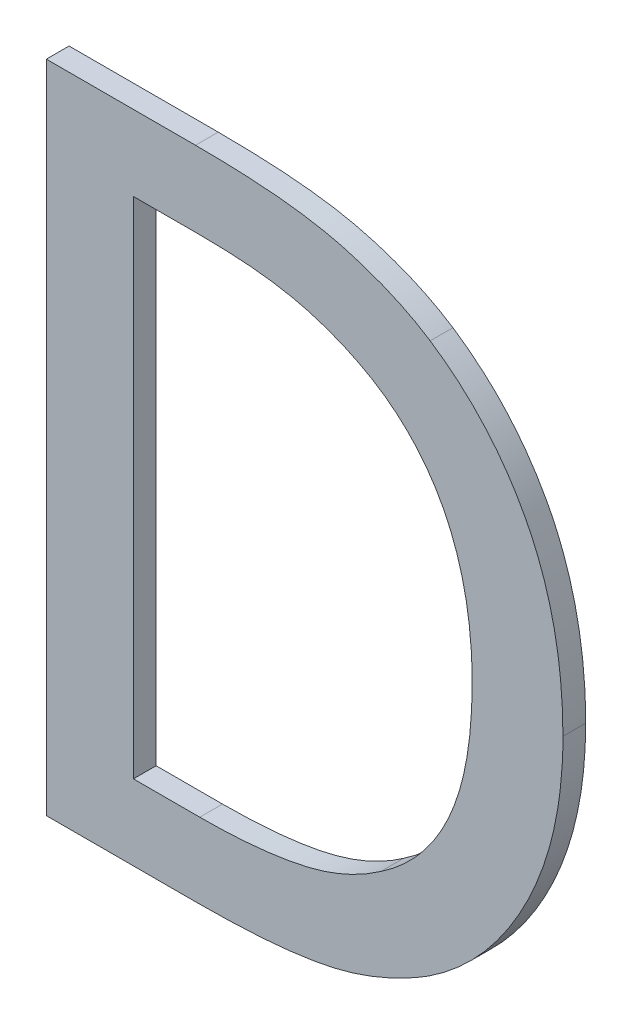
ISO-10303-21;
HEADER;
FILE_DESCRIPTION(('STEP AP214'),'2;1');
FILE_NAME('part.step','',(''),(''),'','','');
FILE_SCHEMA(('AUTOMOTIVE_DESIGN { 1 0 10303 214 1 1 1 1 }'));
ENDSEC;
DATA;
#1=APPLICATION_CONTEXT('core data for automotive mechanical design processes');
#2=APPLICATION_PROTOCOL_DEFINITION('international standard','automotive_design',2000,#1);
#3=PRODUCT_CONTEXT('',#1,'mechanical');
#4=PRODUCT('Part','Part','',(#3));
#5=PRODUCT_RELATED_PRODUCT_CATEGORY('part','',(#4));
#6=PRODUCT_DEFINITION_FORMATION('','',#4);
#7=PRODUCT_DEFINITION_CONTEXT('part definition',#1,'design');
#8=PRODUCT_DEFINITION('design','',#6,#7);
#9=PRODUCT_DEFINITION_SHAPE('','',#8);
#10=(LENGTH_UNIT() NAMED_UNIT(*) SI_UNIT(.MILLI.,.METRE.));
#11=(NAMED_UNIT(*) PLANE_ANGLE_UNIT() SI_UNIT($,.RADIAN.));
#12=(NAMED_UNIT(*) SI_UNIT($,.STERADIAN.) SOLID_ANGLE_UNIT());
#13=UNCERTAINTY_MEASURE_WITH_UNIT(LENGTH_MEASURE(1.E-05),#10,'distance_accuracy_value','');
#14=(GEOMETRIC_REPRESENTATION_CONTEXT(3) GLOBAL_UNCERTAINTY_ASSIGNED_CONTEXT((#13)) GLOBAL_UNIT_ASSIGNED_CONTEXT((#10,
#11,#12)) REPRESENTATION_CONTEXT('',''));
#15=CARTESIAN_POINT('',(0.,0.,0.));
#16=DIRECTION('',(0.,0.,1.));
#17=DIRECTION('',(1.,0.,0.));
#18=AXIS2_PLACEMENT_3D('',#15,#16,#17);
#19=CARTESIAN_POINT('',(-1.22244333232435,-1.32361111170383,0.0042));
#20=DIRECTION('',(0.,0.,1.));
#21=DIRECTION('',(1.,0.,0.));
#22=AXIS2_PLACEMENT_3D('',#19,#20,#21);
#23=PLANE('',#22);
#24=CARTESIAN_POINT('',(-1.1656769492699,-1.40593117939234,0.0042));
#25=CARTESIAN_POINT('',(-1.16226796214847,-1.40368877482768,0.0042));
#26=CARTESIAN_POINT('',(-1.15904539890132,-1.40117312148421,0.0042));
#27=CARTESIAN_POINT('',(-1.15303547050781,-1.39569927236588,0.0042));
#28=CARTESIAN_POINT('',(-1.15024559715268,-1.39274383795295,0.0042));
#29=CARTESIAN_POINT('',(-1.14484406240184,-1.38612562144251,0.0042));
#30=CARTESIAN_POINT('',(-1.14228432387684,-1.38242090616149,0.0042));
#31=CARTESIAN_POINT('',(-1.13768094104223,-1.37469999552973,0.0042));
#32=CARTESIAN_POINT('',(-1.13563804822855,-1.37068335759889,0.0042));
#33=CARTESIAN_POINT('',(-1.13191418630698,-1.36190527264501,0.0042));
#34=CARTESIAN_POINT('',(-1.1303064474216,-1.35711238699186,0.0042));
#35=CARTESIAN_POINT('',(-1.12781738074853,-1.34734839305711,0.0042));
#36=CARTESIAN_POINT('',(-1.1269358697401,-1.34237733005849,0.0042));
#37=CARTESIAN_POINT('',(-1.12588239899949,-1.33286794975659,0.0042));
#38=CARTESIAN_POINT('',(-1.12564777423236,-1.32833662705058,0.0042));
#39=CARTESIAN_POINT('',(-1.12565101838801,-1.32381448786085,0.0042));
#40=B_SPLINE_CURVE_WITH_KNOTS('',3,(#24,#25,#26,#27,#28,#29,#30,#31,#32,#33,#34,#35,#36,#37,#38,
#39),.UNSPECIFIED.,.F.,.F.,(4,2,2,2,2,2,2,4),(0.,0.012220338752033,0.0243669537254382,
0.0378275002875943,0.0513075074959657,0.0664111469989445,0.0815109748221222,0.0950859288527692),.UNSPECIFIED.);
#41=CARTESIAN_POINT('',(-1.1656769492699,-1.40593117939234,0.0042));
#42=VERTEX_POINT('',#41);
#43=CARTESIAN_POINT('',(-1.12565101838801,-1.32381448786085,0.0042));
#44=VERTEX_POINT('',#43);
#45=EDGE_CURVE('E11',#42,#44,#40,.T.);
#46=ORIENTED_EDGE('',*,*,#45,.T.);
#47=CARTESIAN_POINT('',(-1.12565101838801,-1.32381448786085,0.0042));
#48=CARTESIAN_POINT('',(-1.12565290059432,-1.31799965080703,0.0042));
#49=CARTESIAN_POINT('',(-1.12597508426444,-1.31214864847267,0.0042));
#50=CARTESIAN_POINT('',(-1.12745340390291,-1.30052821918136,0.0042));
#51=CARTESIAN_POINT('',(-1.12861371511452,-1.29475934866056,0.0042));
#52=CARTESIAN_POINT('',(-1.13155869649536,-1.28488321817492,0.0042));
#53=CARTESIAN_POINT('',(-1.13312346728012,-1.28071251122146,0.0042));
#54=CARTESIAN_POINT('',(-1.13686364637336,-1.27266586466135,0.0042));
#55=CARTESIAN_POINT('',(-1.1390376404095,-1.26878926847114,0.0042));
#56=CARTESIAN_POINT('',(-1.14378560580661,-1.26162870927181,0.0042));
#57=CARTESIAN_POINT('',(-1.14632667953457,-1.25832294836917,0.0042));
#58=CARTESIAN_POINT('',(-1.15188013365115,-1.25213348457786,0.0042));
#59=CARTESIAN_POINT('',(-1.15489240591479,-1.24924968515564,0.0042));
#60=CARTESIAN_POINT('',(-1.1604221620977,-1.24468100403373,0.0042));
#61=CARTESIAN_POINT('',(-1.16284813763665,-1.24288443142156,0.0042));
#62=CARTESIAN_POINT('',(-1.16535928326501,-1.24122129707704,0.0042));
#63=B_SPLINE_CURVE_WITH_KNOTS('',3,(#47,#48,#49,#50,#51,#52,#53,#54,#55,#56,#57,#58,#59,#60,#61,
#62),.UNSPECIFIED.,.F.,.F.,(4,2,2,2,2,2,2,4),(0.,0.0174937450949404,0.0350752439697529,
0.0483893974746255,0.0616728954901593,0.0741379375117156,0.0866001233896698,0.0956376538121001),.UNSPECIFIED.);
#64=CARTESIAN_POINT('',(-1.16535928315179,-1.2412212971522,0.0042));
#65=VERTEX_POINT('',#64);
#66=EDGE_CURVE('E138',#44,#65,#63,.T.);
#67=ORIENTED_EDGE('',*,*,#66,.T.);
#68=CARTESIAN_POINT('',(-1.16535928315179,-1.2412212971522,0.0042));
#69=CARTESIAN_POINT('',(-1.16823475249016,-1.23932528678903,0.0042));
#70=CARTESIAN_POINT('',(-1.17124353399517,-1.23766151187396,0.0042));
#71=CARTESIAN_POINT('',(-1.17743609494553,-1.23472068739466,0.0042));
#72=CARTESIAN_POINT('',(-1.18061933486027,-1.2334425171367,0.0042));
#73=CARTESIAN_POINT('',(-1.1867507698406,-1.23130236310595,0.0042));
#74=CARTESIAN_POINT('',(-1.18968898715093,-1.2304109232701,0.0042));
#75=CARTESIAN_POINT('',(-1.19564026265934,-1.22891986244688,0.0042));
#76=CARTESIAN_POINT('',(-1.19865334011094,-1.22832031736677,0.0042));
#77=CARTESIAN_POINT('',(-1.20504620014062,-1.22730070538555,0.0042));
#78=CARTESIAN_POINT('',(-1.20842995589935,-1.22690753664746,0.0042));
#79=CARTESIAN_POINT('',(-1.2152143750171,-1.22629850619677,0.0042));
#80=CARTESIAN_POINT('',(-1.21861504852914,-1.2260827684374,0.0042));
#81=CARTESIAN_POINT('',(-1.22427635940779,-1.22583515212994,0.0042));
#82=CARTESIAN_POINT('',(-1.22653550609128,-1.22576583184974,0.0042));
#83=CARTESIAN_POINT('',(-1.23105098877634,-1.22567640286385,0.0042));
#84=CARTESIAN_POINT('',(-1.23330732307525,-1.22565621118488,0.0042));
#85=CARTESIAN_POINT('',(-1.23556349525417,-1.2256556573648,0.0042));
#86=B_SPLINE_CURVE_WITH_KNOTS('',3,(#68,#69,#70,#71,#72,#73,#74,#75,#76,#77,#78,#79,#80,#81,#82,
#83,#84,#85),.UNSPECIFIED.,.F.,.F.,(4,2,2,2,2,2,2,2,4),(0.,0.0102983651994068,
0.0205665050529865,0.0297669387901097,0.0389697638247065,0.0491819738678982,0.0594013121117726,
0.0661814255224453,0.0729500800273479),.UNSPECIFIED.);
#87=CARTESIAN_POINT('',(-1.23556349525415,-1.2256556573648,0.0042));
#88=VERTEX_POINT('',#87);
#89=EDGE_CURVE('E270',#65,#88,#86,.T.);
#90=ORIENTED_EDGE('',*,*,#89,.T.);
#91=DIRECTION('',(-1.,0.,0.));
#92=VECTOR('',#91,1.);
#93=CARTESIAN_POINT('',(-1.23556349525415,-1.2256556573648,0.0042));
#94=LINE('',#93,#92);
#95=CARTESIAN_POINT('',(-1.28019558484863,-1.2256556573648,0.0042));
#96=VERTEX_POINT('',#95);
#97=EDGE_CURVE('E262',#88,#96,#94,.T.);
#98=ORIENTED_EDGE('',*,*,#97,.T.);
#99=DIRECTION('',(0.,-1.,0.));
#100=VECTOR('',#99,1.);
#101=CARTESIAN_POINT('',(-1.28019558484863,-1.2256556573648,0.0042));
#102=LINE('',#101,#100);
#103=CARTESIAN_POINT('',(-1.28019558484863,-1.4216556522388,0.0042));
#104=VERTEX_POINT('',#103);
#105=EDGE_CURVE('E327',#96,#104,#102,.T.);
#106=ORIENTED_EDGE('',*,*,#105,.T.);
#107=DIRECTION('',(1.,0.,0.));
#108=VECTOR('',#107,1.);
#109=CARTESIAN_POINT('',(-1.28019558484863,-1.4216556522388,0.0042));
#110=LINE('',#109,#108);
#111=CARTESIAN_POINT('',(-1.23508699607698,-1.4216556522388,0.0042));
#112=VERTEX_POINT('',#111);
#113=EDGE_CURVE('E335',#104,#112,#110,.T.);
#114=ORIENTED_EDGE('',*,*,#113,.T.);
#115=CARTESIAN_POINT('',(-1.23508699607698,-1.4216556522388,0.0042));
#116=CARTESIAN_POINT('',(-1.22965782614013,-1.42163315204298,0.0042));
#117=CARTESIAN_POINT('',(-1.22421078016452,-1.42152815236535,0.0042));
#118=CARTESIAN_POINT('',(-1.21332106706438,-1.4209299200821,0.0042));
#119=CARTESIAN_POINT('',(-1.20787848617369,-1.42043529229897,0.0042));
#120=CARTESIAN_POINT('',(-1.20018365291523,-1.41929270774119,0.0042));
#121=CARTESIAN_POINT('',(-1.19789680592243,-1.41889654344238,0.0042));
#122=CARTESIAN_POINT('',(-1.19501421588754,-1.41828448437914,0.0042));
#123=CARTESIAN_POINT('',(-1.19440162416368,-1.41814786626207,0.0042));
#124=CARTESIAN_POINT('',(-1.19297246162667,-1.41781106029646,0.0042));
#125=CARTESIAN_POINT('',(-1.19215726174407,-1.41760503913988,0.0042));
#126=CARTESIAN_POINT('',(-1.18970584979281,-1.41694554278227,0.0042));
#127=CARTESIAN_POINT('',(-1.18807980094703,-1.41645389838984,0.0042));
#128=CARTESIAN_POINT('',(-1.18316830045464,-1.41480736921464,0.0042));
#129=CARTESIAN_POINT('',(-1.17993436535907,-1.41349836626551,0.0042));
#130=CARTESIAN_POINT('',(-1.17295528696028,-1.41022287629815,0.0042));
#131=CARTESIAN_POINT('',(-1.16924739777442,-1.40817580079866,0.0042));
#132=CARTESIAN_POINT('',(-1.16567694926363,-1.40593117938841,0.0042));
#133=B_SPLINE_CURVE_WITH_KNOTS('',3,(#115,#116,#117,#118,#119,#120,#121,#122,#123,#124,#125,
#126,#127,#128,#129,#130,#131,#132),.UNSPECIFIED.,.F.,.F.,(4,2,2,2,2,2,2,2,4),(0.,
0.016316861040279,0.0326924164488062,0.0396499415949164,0.0415327145926748,0.0440548165126128,
0.0491478489597155,0.059591960010783,0.0722536707700071),.UNSPECIFIED.);
#134=EDGE_CURVE('E379',#112,#42,#133,.T.);
#135=ORIENTED_EDGE('',*,*,#134,.T.);
#136=EDGE_LOOP('',(#46,#67,#90,#98,#106,#114,#135));
#137=FACE_BOUND('',#136,.T.);
#138=CARTESIAN_POINT('',(-1.18013075764391,-1.38607704701045,0.0042));
#139=CARTESIAN_POINT('',(-1.18278640678735,-1.38794205282062,0.0042));
#140=CARTESIAN_POINT('',(-1.18558917076831,-1.38960230047919,0.0042));
#141=CARTESIAN_POINT('',(-1.19137209302119,-1.39245370417578,0.0042));
#142=CARTESIAN_POINT('',(-1.19434900342481,-1.39365145283762,0.0042));
#143=CARTESIAN_POINT('',(-1.20089937565251,-1.3957186678996,0.0042));
#144=CARTESIAN_POINT('',(-1.20449576820312,-1.39651294853562,0.0042));
#145=CARTESIAN_POINT('',(-1.21176358422995,-1.39775109159515,0.0042));
#146=CARTESIAN_POINT('',(-1.21543535126144,-1.39819253938611,0.0042));
#147=CARTESIAN_POINT('',(-1.22165229347342,-1.39871443313328,0.0042));
#148=CARTESIAN_POINT('',(-1.22419178641683,-1.39886452129769,0.0042));
#149=CARTESIAN_POINT('',(-1.22925211653744,-1.39905728258083,0.0042));
#150=CARTESIAN_POINT('',(-1.2317729162793,-1.39910090887609,0.0042));
#151=CARTESIAN_POINT('',(-1.2342928307817,-1.39910135785297,0.0042));
#152=B_SPLINE_CURVE_WITH_KNOTS('',3,(#138,#139,#140,#141,#142,#143,#144,#145,#146,#147,#148,
#149,#150,#151),.UNSPECIFIED.,.F.,.F.,(4,2,2,2,2,2,4),(0.,0.00973135167306938,
0.0193183611732213,0.0303293610604299,0.0414150851931192,0.0490444027715868,0.056605158618522),.UNSPECIFIED.);
#153=CARTESIAN_POINT('',(-1.18013075764391,-1.38607704701045,0.0042));
#154=VERTEX_POINT('',#153);
#155=CARTESIAN_POINT('',(-1.2342928307817,-1.39910135785297,0.0042));
#156=VERTEX_POINT('',#155);
#157=EDGE_CURVE('E222',#154,#156,#152,.T.);
#158=ORIENTED_EDGE('',*,*,#157,.T.);
#159=DIRECTION('',(-1.,0.,0.));
#160=VECTOR('',#159,1.);
#161=CARTESIAN_POINT('',(-1.2342928307817,-1.39910135785297,0.0042));
#162=LINE('',#161,#160);
#163=CARTESIAN_POINT('',(-1.25414696316359,-1.39910135785297,0.0042));
#164=VERTEX_POINT('',#163);
#165=EDGE_CURVE('E269',#156,#164,#162,.T.);
#166=ORIENTED_EDGE('',*,*,#165,.T.);
#167=DIRECTION('',(0.,1.,0.));
#168=VECTOR('',#167,1.);
#169=CARTESIAN_POINT('',(-1.25414696316359,-1.39910135785297,0.0042));
#170=LINE('',#169,#168);
#171=CARTESIAN_POINT('',(-1.25414696316359,-1.24820995175062,0.0042));
#172=VERTEX_POINT('',#171);
#173=EDGE_CURVE('E319',#164,#172,#170,.T.);
#174=ORIENTED_EDGE('',*,*,#173,.T.);
#175=DIRECTION('',(1.,0.,0.));
#176=VECTOR('',#175,1.);
#177=CARTESIAN_POINT('',(-1.25414696316359,-1.24820995175062,0.0042));
#178=LINE('',#177,#176);
#179=CARTESIAN_POINT('',(-1.2342928307817,-1.24820995175062,0.0042));
#180=VERTEX_POINT('',#179);
#181=EDGE_CURVE('E329',#172,#180,#178,.T.);
#182=ORIENTED_EDGE('',*,*,#181,.T.);
#183=CARTESIAN_POINT('',(-1.2342928307817,-1.24820995175062,0.0042));
#184=CARTESIAN_POINT('',(-1.23007624953366,-1.24823666020874,0.0042));
#185=CARTESIAN_POINT('',(-1.22583741090546,-1.24833668599334,0.0042));
#186=CARTESIAN_POINT('',(-1.21736605095977,-1.24890369685636,0.0042));
#187=CARTESIAN_POINT('',(-1.21313366977018,-1.24937253345549,0.0042));
#188=CARTESIAN_POINT('',(-1.20647879141162,-1.25058926986174,0.0042));
#189=CARTESIAN_POINT('',(-1.20402338439327,-1.25114487193716,0.0042));
#190=CARTESIAN_POINT('',(-1.19918384883077,-1.25249047857274,0.0042));
#191=CARTESIAN_POINT('',(-1.19679956191657,-1.25327991160303,0.0042));
#192=CARTESIAN_POINT('',(-1.19239495381733,-1.25497438686888,0.0042));
#193=CARTESIAN_POINT('',(-1.19036501373185,-1.25585459847605,0.0042));
#194=CARTESIAN_POINT('',(-1.18637858814226,-1.25778406584953,0.0042));
#195=CARTESIAN_POINT('',(-1.18442237588658,-1.25883388625941,0.0042));
#196=CARTESIAN_POINT('',(-1.18251325352913,-1.25996359812106,0.0042));
#197=B_SPLINE_CURVE_WITH_KNOTS('',3,(#183,#184,#185,#186,#187,#188,#189,#190,#191,#192,#193,
#194,#195,#196),.UNSPECIFIED.,.F.,.F.,(4,2,2,2,2,2,4),(0.,0.0126870376171845,0.0254381769188613,
0.0329792319329267,0.0405020050868415,0.047132198769791,0.0537849379035661),.UNSPECIFIED.);
#198=CARTESIAN_POINT('',(-1.18251325352974,-1.2599635981207,0.0042));
#199=VERTEX_POINT('',#198);
#200=EDGE_CURVE('E336',#180,#199,#197,.T.);
#201=ORIENTED_EDGE('',*,*,#200,.T.);
#202=CARTESIAN_POINT('',(-1.18251325352974,-1.2599635981207,0.0042));
#203=CARTESIAN_POINT('',(-1.17997489491251,-1.26150994269405,0.0042));
#204=CARTESIAN_POINT('',(-1.17755407198908,-1.26325368654539,0.0042));
#205=CARTESIAN_POINT('',(-1.17302135416949,-1.26708784348986,0.0042));
#206=CARTESIAN_POINT('',(-1.17090828507756,-1.2691768703508,0.0042));
#207=CARTESIAN_POINT('',(-1.1670791572081,-1.27362540238694,0.0042));
#208=CARTESIAN_POINT('',(-1.16535657614708,-1.27597929653661,0.0042));
#209=CARTESIAN_POINT('',(-1.16227782362398,-1.28091413183741,0.0042));
#210=CARTESIAN_POINT('',(-1.16092170320191,-1.28349510454935,0.0042));
#211=CARTESIAN_POINT('',(-1.15703147567877,-1.29225985739344,0.0042));
#212=CARTESIAN_POINT('',(-1.1552541523089,-1.29877030837585,0.0042));
#213=CARTESIAN_POINT('',(-1.15320444668248,-1.31140484052071,0.0042));
#214=CARTESIAN_POINT('',(-1.15280611012585,-1.31750757490977,0.0042));
#215=CARTESIAN_POINT('',(-1.15281147148643,-1.32349682174274,0.0042));
#216=B_SPLINE_CURVE_WITH_KNOTS('',3,(#202,#203,#204,#205,#206,#207,#208,#209,#210,#211,#212,
#213,#214,#215),.UNSPECIFIED.,.F.,.F.,(4,2,2,2,2,2,4),(0.,0.00891216131327491,
0.0177893747438777,0.0265051163780563,0.0352220713007727,0.0552574035849195,0.0734060894511739),.UNSPECIFIED.);
#217=CARTESIAN_POINT('',(-1.15281147148643,-1.32349682174274,0.0042));
#218=VERTEX_POINT('',#217);
#219=EDGE_CURVE('E373',#199,#218,#216,.T.);
#220=ORIENTED_EDGE('',*,*,#219,.T.);
#221=CARTESIAN_POINT('',(-1.15281147148643,-1.32349682174274,0.0042));
#222=CARTESIAN_POINT('',(-1.1528331713859,-1.32809372733658,0.0042));
#223=CARTESIAN_POINT('',(-1.15302530779963,-1.33271368628184,0.0042));
#224=CARTESIAN_POINT('',(-1.15399149791638,-1.3419501292428,0.0042));
#225=CARTESIAN_POINT('',(-1.15477335974063,-1.3465657271906,0.0042));
#226=CARTESIAN_POINT('',(-1.15756005724956,-1.35707621611907,0.0042));
#227=CARTESIAN_POINT('',(-1.15987851177529,-1.36290237656357,0.0042));
#228=CARTESIAN_POINT('',(-1.16594889395841,-1.37295710207709,0.0042));
#229=CARTESIAN_POINT('',(-1.16952487892519,-1.37728915531179,0.0042));
#230=CARTESIAN_POINT('',(-1.17567556956797,-1.38285765520499,0.0042));
#231=CARTESIAN_POINT('',(-1.17784805593206,-1.38455460502626,0.0042));
#232=CARTESIAN_POINT('',(-1.180130757745,-1.38607704707863,0.0042));
#233=B_SPLINE_CURVE_WITH_KNOTS('',3,(#221,#222,#223,#224,#225,#226,#227,#228,#229,#230,#231,
#232),.UNSPECIFIED.,.F.,.F.,(4,2,2,2,2,4),(0.,0.0138215914949219,0.0278294690303939,
0.0463651923326638,0.0629559480585555,0.0711944872630673),.UNSPECIFIED.);
#234=EDGE_CURVE('E253',#218,#154,#233,.T.);
#235=ORIENTED_EDGE('',*,*,#234,.T.);
#236=EDGE_LOOP('',(#158,#166,#174,#182,#201,#220,#235));
#237=FACE_BOUND('',#236,.T.);
#238=ADVANCED_FACE('F17',(#137,#237),#23,.T.);
#239=CARTESIAN_POINT('',(-1.18013075764391,-1.38607704701045,-0.0026));
#240=CARTESIAN_POINT('',(-1.18013075764391,-1.38607704701045,0.0042));
#241=CARTESIAN_POINT('',(-1.16647111456517,-1.37686472958526,-0.0026));
#242=CARTESIAN_POINT('',(-1.16647111456517,-1.37686472958526,0.0042));
#243=CARTESIAN_POINT('',(-1.15281147148643,-1.34636878224668,-0.0026));
#244=CARTESIAN_POINT('',(-1.15281147148643,-1.34636878224668,0.0042));
#245=CARTESIAN_POINT('',(-1.15281147148643,-1.32349682174274,-0.0026));
#246=CARTESIAN_POINT('',(-1.15281147148643,-1.32349682174274,0.0042));
#247=B_SPLINE_SURFACE_WITH_KNOTS('',2,1,((#239,#240),(#241,#242),(#243,#244),(#245,#246)),
.UNSPECIFIED.,.F.,.F.,.F.,(3,1,3),(2,2),(0.,0.5,1.),(0.,1.),.UNSPECIFIED.);
#248=CARTESIAN_POINT('',(-1.18013075764391,-1.38607704701045,-0.0026));
#249=CARTESIAN_POINT('',(-1.17766654141075,-1.3844219587591,-0.0026));
#250=CARTESIAN_POINT('',(-1.1753293141664,-1.38257949955947,-0.0026));
#251=CARTESIAN_POINT('',(-1.17097541913938,-1.37856119415743,-0.0026));
#252=CARTESIAN_POINT('',(-1.16895779433595,-1.37638638311356,-0.0026));
#253=CARTESIAN_POINT('',(-1.16354778612808,-1.36951706015858,-0.0026));
#254=CARTESIAN_POINT('',(-1.16067806382398,-1.36439670698081,-0.0026));
#255=CARTESIAN_POINT('',(-1.15623812786505,-1.35318179785166,-0.0026));
#256=CARTESIAN_POINT('',(-1.1547976967479,-1.34704151431949,-0.0026));
#257=CARTESIAN_POINT('',(-1.15314255738751,-1.33505845631907,-0.0026));
#258=CARTESIAN_POINT('',(-1.15284324328928,-1.32922839308657,-0.0026));
#259=CARTESIAN_POINT('',(-1.15281147148643,-1.32349682174274,-0.0026));
#260=B_SPLINE_CURVE_WITH_KNOTS('',3,(#248,#249,#250,#251,#252,#253,#254,#255,#256,#257,#258,
#259),.UNSPECIFIED.,.F.,.F.,(4,2,2,2,2,4),(0.,0.00889393051447318,0.017760703863996,
0.0350788794411588,0.0538554261933466,0.0712092277444972),.UNSPECIFIED.);
#261=CARTESIAN_POINT('',(-1.18013075764391,-1.38607704701045,-0.0026));
#262=VERTEX_POINT('',#261);
#263=CARTESIAN_POINT('',(-1.15281147148643,-1.32349682174274,-0.0026));
#264=VERTEX_POINT('',#263);
#265=EDGE_CURVE('E30',#262,#264,#260,.T.);
#266=DIRECTION('',(0.,0.,1.));
#267=VECTOR('',#266,1.);
#268=CARTESIAN_POINT('',(-1.18013075764391,-1.38607704701045,-0.0026));
#269=LINE('',#268,#267);
#270=EDGE_CURVE('E223',#262,#154,#269,.T.);
#271=DIRECTION('',(0.,0.,1.));
#272=VECTOR('',#271,1.);
#273=CARTESIAN_POINT('',(-1.15281147148643,-1.32349682174274,-0.0026));
#274=LINE('',#273,#272);
#275=EDGE_CURVE('E316',#264,#218,#274,.T.);
#276=ORIENTED_EDGE('',*,*,#265,.F.);
#277=ORIENTED_EDGE('',*,*,#270,.T.);
#278=ORIENTED_EDGE('',*,*,#234,.F.);
#279=ORIENTED_EDGE('',*,*,#275,.F.);
#280=EDGE_LOOP('',(#276,#277,#278,#279));
#281=FACE_BOUND('',#280,.T.);
#282=ADVANCED_FACE('F238',(#281),#247,.F.);
#283=CARTESIAN_POINT('',(-1.2342928307817,-1.39910135785297,-0.0026));
#284=CARTESIAN_POINT('',(-1.2342928307817,-1.39910135785297,0.0042));
#285=CARTESIAN_POINT('',(-1.2169800273447,-1.39910135785297,-0.0026));
#286=CARTESIAN_POINT('',(-1.2169800273447,-1.39910135785297,0.0042));
#287=CARTESIAN_POINT('',(-1.19077257260061,-1.39354220078604,-0.0026));
#288=CARTESIAN_POINT('',(-1.19077257260061,-1.39354220078604,0.0042));
#289=CARTESIAN_POINT('',(-1.18013075764391,-1.38607704701045,-0.0026));
#290=CARTESIAN_POINT('',(-1.18013075764391,-1.38607704701045,0.0042));
#291=B_SPLINE_SURFACE_WITH_KNOTS('',2,1,((#283,#284),(#285,#286),(#287,#288),(#289,#290)),
.UNSPECIFIED.,.F.,.F.,.F.,(3,1,3),(2,2),(0.,0.5,1.),(0.,1.),.UNSPECIFIED.);
#292=CARTESIAN_POINT('',(-1.2342928307817,-1.39910135785297,-0.0026));
#293=CARTESIAN_POINT('',(-1.23177180883286,-1.399099530763,-0.0026));
#294=CARTESIAN_POINT('',(-1.22924971822862,-1.39905654962234,-0.0026));
#295=CARTESIAN_POINT('',(-1.22420265803102,-1.39886557857411,-0.0026));
#296=CARTESIAN_POINT('',(-1.22167769989146,-1.39871729739724,-0.0026));
#297=CARTESIAN_POINT('',(-1.21659155731685,-1.39828885329593,-0.0026));
#298=CARTESIAN_POINT('',(-1.21403056826159,-1.39800629821952,-0.0026));
#299=CARTESIAN_POINT('',(-1.208930571878,-1.39729663068613,-0.0026));
#300=CARTESIAN_POINT('',(-1.20639154545421,-1.39686966027755,-0.0026));
#301=CARTESIAN_POINT('',(-1.20059767638249,-1.39560761625002,-0.0026));
#302=CARTESIAN_POINT('',(-1.19735945930984,-1.39468801244633,-0.0026));
#303=CARTESIAN_POINT('',(-1.19109563119323,-1.39234327676198,-0.0026));
#304=CARTESIAN_POINT('',(-1.1880686230821,-1.39092193963783,-0.0026));
#305=CARTESIAN_POINT('',(-1.18344269872714,-1.38828719394088,-0.0026));
#306=CARTESIAN_POINT('',(-1.18175903420392,-1.38722004801915,-0.0026));
#307=CARTESIAN_POINT('',(-1.18013075756667,-1.38607704695627,-0.0026));
#308=B_SPLINE_CURVE_WITH_KNOTS('',3,(#292,#293,#294,#295,#296,#297,#298,#299,#300,#301,#302,
#303,#304,#305,#306,#307),.UNSPECIFIED.,.F.,.F.,(4,2,2,2,2,2,2,4),(0.,0.00756444232666839,
0.0151498904889554,0.0228758548212939,0.0305942418093433,0.0406551626389473,0.050641564995139,
0.0566117657849047),.UNSPECIFIED.);
#309=CARTESIAN_POINT('',(-1.2342928307817,-1.39910135785297,-0.0026));
#310=VERTEX_POINT('',#309);
#311=EDGE_CURVE('E214',#310,#262,#308,.T.);
#312=DIRECTION('',(0.,0.,1.));
#313=VECTOR('',#312,1.);
#314=CARTESIAN_POINT('',(-1.2342928307817,-1.39910135785297,-0.0026));
#315=LINE('',#314,#313);
#316=EDGE_CURVE('E261',#310,#156,#315,.T.);
#317=ORIENTED_EDGE('',*,*,#311,.F.);
#318=ORIENTED_EDGE('',*,*,#316,.T.);
#319=ORIENTED_EDGE('',*,*,#157,.F.);
#320=ORIENTED_EDGE('',*,*,#270,.F.);
#321=EDGE_LOOP('',(#317,#318,#319,#320));
#322=FACE_BOUND('',#321,.T.);
#323=ADVANCED_FACE('F165',(#322),#291,.F.);
#324=CARTESIAN_POINT('',(-1.25414696316359,-1.39910135785297,-0.0026));
#325=DIRECTION('',(0.,-1.,0.));
#326=DIRECTION('',(1.,0.,0.));
#327=AXIS2_PLACEMENT_3D('',#324,#325,#326);
#328=PLANE('',#327);
#329=DIRECTION('',(1.,0.,0.));
#330=VECTOR('',#329,1.);
#331=CARTESIAN_POINT('',(-1.25414696316359,-1.39910135785297,-0.0026));
#332=LINE('',#331,#330);
#333=CARTESIAN_POINT('',(-1.25414696316359,-1.39910135785297,-0.0026));
#334=VERTEX_POINT('',#333);
#335=EDGE_CURVE('E266',#334,#310,#332,.T.);
#336=ORIENTED_EDGE('',*,*,#335,.F.);
#337=DIRECTION('',(0.,0.,1.));
#338=VECTOR('',#337,1.);
#339=CARTESIAN_POINT('',(-1.25414696316359,-1.39910135785297,-0.0026));
#340=LINE('',#339,#338);
#341=EDGE_CURVE('E312',#334,#164,#340,.T.);
#342=ORIENTED_EDGE('',*,*,#341,.T.);
#343=ORIENTED_EDGE('',*,*,#165,.F.);
#344=ORIENTED_EDGE('',*,*,#316,.F.);
#345=EDGE_LOOP('',(#336,#342,#343,#344));
#346=FACE_BOUND('',#345,.T.);
#347=ADVANCED_FACE('F285',(#346),#328,.F.);
#348=CARTESIAN_POINT('',(-1.25414696316359,-1.24820995175062,-0.0026));
#349=DIRECTION('',(-1.,0.,0.));
#350=DIRECTION('',(0.,-1.,0.));
#351=AXIS2_PLACEMENT_3D('',#348,#349,#350);
#352=PLANE('',#351);
#353=DIRECTION('',(0.,-1.,0.));
#354=VECTOR('',#353,1.);
#355=CARTESIAN_POINT('',(-1.25414696316359,-1.24820995175062,-0.0026));
#356=LINE('',#355,#354);
#357=CARTESIAN_POINT('',(-1.25414696316359,-1.24820995175062,-0.0026));
#358=VERTEX_POINT('',#357);
#359=EDGE_CURVE('E315',#358,#334,#356,.T.);
#360=ORIENTED_EDGE('',*,*,#359,.F.);
#361=DIRECTION('',(0.,0.,1.));
#362=VECTOR('',#361,1.);
#363=CARTESIAN_POINT('',(-1.25414696316359,-1.24820995175062,-0.0026));
#364=LINE('',#363,#362);
#365=EDGE_CURVE('E321',#358,#172,#364,.T.);
#366=ORIENTED_EDGE('',*,*,#365,.T.);
#367=ORIENTED_EDGE('',*,*,#173,.F.);
#368=ORIENTED_EDGE('',*,*,#341,.F.);
#369=EDGE_LOOP('',(#360,#366,#367,#368));
#370=FACE_BOUND('',#369,.T.);
#371=ADVANCED_FACE('F283',(#370),#352,.F.);
#372=CARTESIAN_POINT('',(-1.2342928307817,-1.24820995175062,-0.0026));
#373=DIRECTION('',(0.,1.,0.));
#374=DIRECTION('',(-1.,0.,0.));
#375=AXIS2_PLACEMENT_3D('',#372,#373,#374);
#376=PLANE('',#375);
#377=DIRECTION('',(-1.,0.,0.));
#378=VECTOR('',#377,1.);
#379=CARTESIAN_POINT('',(-1.2342928307817,-1.24820995175062,-0.0026));
#380=LINE('',#379,#378);
#381=CARTESIAN_POINT('',(-1.2342928307817,-1.24820995175062,-0.0026));
#382=VERTEX_POINT('',#381);
#383=EDGE_CURVE('E331',#382,#358,#380,.T.);
#384=ORIENTED_EDGE('',*,*,#383,.F.);
#385=DIRECTION('',(0.,0.,1.));
#386=VECTOR('',#385,1.);
#387=CARTESIAN_POINT('',(-1.2342928307817,-1.24820995175062,-0.0026));
#388=LINE('',#387,#386);
#389=EDGE_CURVE('E384',#382,#180,#388,.T.);
#390=ORIENTED_EDGE('',*,*,#389,.T.);
#391=ORIENTED_EDGE('',*,*,#181,.F.);
#392=ORIENTED_EDGE('',*,*,#365,.F.);
#393=EDGE_LOOP('',(#384,#390,#391,#392));
#394=FACE_BOUND('',#393,.T.);
#395=ADVANCED_FACE('F299',(#394),#376,.F.);
#396=CARTESIAN_POINT('',(-1.18251325352974,-1.2599635981207,-0.0026));
#397=CARTESIAN_POINT('',(-1.18251325352974,-1.2599635981207,0.0042));
#398=CARTESIAN_POINT('',(-1.19299623542738,-1.25376910881755,-0.0026));
#399=CARTESIAN_POINT('',(-1.19299623542738,-1.25376910881755,0.0042));
#400=CARTESIAN_POINT('',(-1.21666236122659,-1.24820995175062,-0.0026));
#401=CARTESIAN_POINT('',(-1.21666236122659,-1.24820995175062,0.0042));
#402=CARTESIAN_POINT('',(-1.2342928307817,-1.24820995175062,-0.0026));
#403=CARTESIAN_POINT('',(-1.2342928307817,-1.24820995175062,0.0042));
#404=B_SPLINE_SURFACE_WITH_KNOTS('',2,1,((#396,#397),(#398,#399),(#400,#401),(#402,#403)),
.UNSPECIFIED.,.F.,.F.,.F.,(3,1,3),(2,2),(0.,0.5,1.),(0.,1.),.UNSPECIFIED.);
#405=CARTESIAN_POINT('',(-1.18251325352974,-1.2599635981207,-0.0026));
#406=CARTESIAN_POINT('',(-1.18599305195404,-1.25789718148298,-0.0026));
#407=CARTESIAN_POINT('',(-1.18963786691601,-1.25610335650895,-0.0026));
#408=CARTESIAN_POINT('',(-1.19711193443373,-1.25310921969356,-0.0026));
#409=CARTESIAN_POINT('',(-1.20093838164852,-1.25190190844893,-0.0026));
#410=CARTESIAN_POINT('',(-1.20994389589962,-1.24979021209433,-0.0026));
#411=CARTESIAN_POINT('',(-1.21516989037915,-1.24910050932489,-0.0026));
#412=CARTESIAN_POINT('',(-1.22504542280122,-1.24836011372997,-0.0026));
#413=CARTESIAN_POINT('',(-1.22968954162743,-1.24824313696746,-0.0026));
#414=CARTESIAN_POINT('',(-1.2342928307817,-1.24820995175062,-0.0026));
#415=B_SPLINE_CURVE_WITH_KNOTS('',3,(#405,#406,#407,#408,#409,#410,#411,#412,#413,#414),
.UNSPECIFIED.,.F.,.F.,(4,2,2,2,4),(0.,0.0121357216451952,0.0241228236887913,0.0398798311196032,
0.0537614681417285),.UNSPECIFIED.);
#416=CARTESIAN_POINT('',(-1.18251325352974,-1.2599635981207,-0.0026));
#417=VERTEX_POINT('',#416);
#418=EDGE_CURVE('E205',#417,#382,#415,.T.);
#419=DIRECTION('',(0.,0.,1.));
#420=VECTOR('',#419,1.);
#421=CARTESIAN_POINT('',(-1.18251325352974,-1.2599635981207,-0.0026));
#422=LINE('',#421,#420);
#423=EDGE_CURVE('E405',#417,#199,#422,.T.);
#424=ORIENTED_EDGE('',*,*,#418,.F.);
#425=ORIENTED_EDGE('',*,*,#423,.T.);
#426=ORIENTED_EDGE('',*,*,#200,.F.);
#427=ORIENTED_EDGE('',*,*,#389,.F.);
#428=EDGE_LOOP('',(#424,#425,#426,#427));
#429=FACE_BOUND('',#428,.T.);
#430=ADVANCED_FACE('F341',(#429),#404,.F.);
#431=CARTESIAN_POINT('',(-1.15281147148643,-1.32349682174274,-0.0026));
#432=CARTESIAN_POINT('',(-1.15281147148643,-1.32349682174274,0.0042));
#433=CARTESIAN_POINT('',(-1.15281147148643,-1.30094252735692,-0.0026));
#434=CARTESIAN_POINT('',(-1.15281147148643,-1.30094252735692,0.0042));
#435=CARTESIAN_POINT('',(-1.16774177903761,-1.26901708248684,-0.0026));
#436=CARTESIAN_POINT('',(-1.16774177903761,-1.26901708248684,0.0042));
#437=CARTESIAN_POINT('',(-1.18251325352974,-1.2599635981207,-0.0026));
#438=CARTESIAN_POINT('',(-1.18251325352974,-1.2599635981207,0.0042));
#439=B_SPLINE_SURFACE_WITH_KNOTS('',2,1,((#431,#432),(#433,#434),(#435,#436),(#437,#438)),
.UNSPECIFIED.,.F.,.F.,.F.,(3,1,3),(2,2),(0.,0.5,1.),(0.,1.),.UNSPECIFIED.);
#440=CARTESIAN_POINT('',(-1.15281147148643,-1.32349682174274,-0.0026));
#441=CARTESIAN_POINT('',(-1.15281972499874,-1.31882414010876,-0.0026));
#442=CARTESIAN_POINT('',(-1.15305373529469,-1.31413411238155,-0.0026));
#443=CARTESIAN_POINT('',(-1.15416518567174,-1.30477198995066,-0.0026));
#444=CARTESIAN_POINT('',(-1.15505117220885,-1.3001009701561,-0.0026));
#445=CARTESIAN_POINT('',(-1.15817411733462,-1.28919396525523,-0.0026));
#446=CARTESIAN_POINT('',(-1.160800883109,-1.283050910463,-0.0026));
#447=CARTESIAN_POINT('',(-1.16756650355639,-1.2726752629249,-0.0026));
#448=CARTESIAN_POINT('',(-1.17148177728155,-1.2683010252554,-0.0026));
#449=CARTESIAN_POINT('',(-1.17802376126912,-1.26291166073377,-0.0026));
#450=CARTESIAN_POINT('',(-1.18021916994581,-1.2613514411752,-0.0026));
#451=CARTESIAN_POINT('',(-1.18251325361745,-1.25996359806694,-0.0026));
#452=B_SPLINE_CURVE_WITH_KNOTS('',3,(#440,#441,#442,#443,#444,#445,#446,#447,#448,#449,#450,
#451),.UNSPECIFIED.,.F.,.F.,(4,2,2,2,2,4),(0.,0.0140352318960615,0.0282577983281538,
0.047977539357689,0.0652913866151169,0.0733421237539573),.UNSPECIFIED.);
#453=EDGE_CURVE('E197',#264,#417,#452,.T.);
#454=ORIENTED_EDGE('',*,*,#453,.F.);
#455=ORIENTED_EDGE('',*,*,#275,.T.);
#456=ORIENTED_EDGE('',*,*,#219,.F.);
#457=ORIENTED_EDGE('',*,*,#423,.F.);
#458=EDGE_LOOP('',(#454,#455,#456,#457));
#459=FACE_BOUND('',#458,.T.);
#460=ADVANCED_FACE('F348',(#459),#439,.F.);
#461=CARTESIAN_POINT('',(-1.23508699607698,-1.4216556522388,-0.0026));
#462=CARTESIAN_POINT('',(-1.23508699607698,-1.4216556522388,0.0042));
#463=CARTESIAN_POINT('',(-1.21126203721871,-1.4216556522388,-0.0026));
#464=CARTESIAN_POINT('',(-1.21126203721871,-1.4216556522388,0.0042));
#465=CARTESIAN_POINT('',(-1.18060725682108,-1.41530232987659,-0.0026));
#466=CARTESIAN_POINT('',(-1.18060725682108,-1.41530232987659,0.0042));
#467=CARTESIAN_POINT('',(-1.1656769492699,-1.40593117939234,-0.0026));
#468=CARTESIAN_POINT('',(-1.1656769492699,-1.40593117939234,0.0042));
#469=B_SPLINE_SURFACE_WITH_KNOTS('',2,1,((#461,#462),(#463,#464),(#465,#466),(#467,#468)),
.UNSPECIFIED.,.F.,.F.,.F.,(3,1,3),(2,2),(0.,0.5,1.),(0.,1.),.UNSPECIFIED.);
#470=CARTESIAN_POINT('',(-1.1656769492699,-1.40593117939234,-0.0026));
#471=CARTESIAN_POINT('',(-1.16970701819979,-1.40846739803206,-0.0026));
#472=CARTESIAN_POINT('',(-1.17392396586701,-1.41075419805006,-0.0026));
#473=CARTESIAN_POINT('',(-1.182629849993,-1.41465592901485,-0.0026));
#474=CARTESIAN_POINT('',(-1.18711734480671,-1.41627411306706,-0.0026));
#475=CARTESIAN_POINT('',(-1.19321088116873,-1.41787909538241,-0.0026));
#476=CARTESIAN_POINT('',(-1.19472245755019,-1.41823069176158,-0.0026));
#477=CARTESIAN_POINT('',(-1.19686751433957,-1.41867042771504,-0.0026));
#478=CARTESIAN_POINT('',(-1.19749434125257,-1.41879185825287,-0.0026));
#479=CARTESIAN_POINT('',(-1.19898772403308,-1.41906851637332,-0.0026));
#480=CARTESIAN_POINT('',(-1.19985513751609,-1.41921912013099,-0.0026));
#481=CARTESIAN_POINT('',(-1.20256171564722,-1.41965954523865,-0.0026));
#482=CARTESIAN_POINT('',(-1.20440611838913,-1.41991738551923,-0.0026));
#483=CARTESIAN_POINT('',(-1.21036141560989,-1.42064517834059,-0.0026));
#484=CARTESIAN_POINT('',(-1.21448697882861,-1.4209891602308,-0.0026));
#485=CARTESIAN_POINT('',(-1.22410467604118,-1.42152813911612,-0.0026));
#486=CARTESIAN_POINT('',(-1.22960236849423,-1.42163758928951,-0.0026));
#487=CARTESIAN_POINT('',(-1.23508699607699,-1.4216556522388,-0.0026));
#488=B_SPLINE_CURVE_WITH_KNOTS('',3,(#470,#471,#472,#473,#474,#475,#476,#477,#478,#479,#480,
#481,#482,#483,#484,#485,#486,#487),.UNSPECIFIED.,.F.,.F.,(4,2,2,2,2,2,2,2,4),(0.,
0.0143171433933299,0.0285637832779628,0.0332171752608365,0.0351325350939672,0.0377735038409633,
0.0433588079021744,0.0557712645538521,0.0722441584477859),.UNSPECIFIED.);
#489=CARTESIAN_POINT('',(-1.1656769492699,-1.40593117939234,-0.0026));
#490=VERTEX_POINT('',#489);
#491=CARTESIAN_POINT('',(-1.23508699607698,-1.4216556522388,-0.0026));
#492=VERTEX_POINT('',#491);
#493=EDGE_CURVE('E187',#490,#492,#488,.T.);
#494=DIRECTION('',(0.,0.,1.));
#495=VECTOR('',#494,1.);
#496=CARTESIAN_POINT('',(-1.1656769492699,-1.40593117939234,-0.0026));
#497=LINE('',#496,#495);
#498=EDGE_CURVE('E126',#490,#42,#497,.T.);
#499=DIRECTION('',(0.,0.,1.));
#500=VECTOR('',#499,1.);
#501=CARTESIAN_POINT('',(-1.23508699607698,-1.4216556522388,-0.0026));
#502=LINE('',#501,#500);
#503=EDGE_CURVE('E403',#492,#112,#502,.T.);
#504=ORIENTED_EDGE('',*,*,#493,.F.);
#505=ORIENTED_EDGE('',*,*,#498,.T.);
#506=ORIENTED_EDGE('',*,*,#134,.F.);
#507=ORIENTED_EDGE('',*,*,#503,.F.);
#508=EDGE_LOOP('',(#504,#505,#506,#507));
#509=FACE_BOUND('',#508,.T.);
#510=ADVANCED_FACE('F365',(#509),#469,.T.);
#511=CARTESIAN_POINT('',(-1.28019558484863,-1.4216556522388,-0.0026));
#512=DIRECTION('',(0.,-1.,0.));
#513=DIRECTION('',(1.,0.,0.));
#514=AXIS2_PLACEMENT_3D('',#511,#512,#513);
#515=PLANE('',#514);
#516=DIRECTION('',(-1.,0.,0.));
#517=VECTOR('',#516,1.);
#518=CARTESIAN_POINT('',(-1.23508699607698,-1.4216556522388,-0.0026));
#519=LINE('',#518,#517);
#520=CARTESIAN_POINT('',(-1.28019558484863,-1.4216556522388,-0.0026));
#521=VERTEX_POINT('',#520);
#522=EDGE_CURVE('E406',#492,#521,#519,.T.);
#523=ORIENTED_EDGE('',*,*,#522,.F.);
#524=ORIENTED_EDGE('',*,*,#503,.T.);
#525=ORIENTED_EDGE('',*,*,#113,.F.);
#526=DIRECTION('',(0.,0.,1.));
#527=VECTOR('',#526,1.);
#528=CARTESIAN_POINT('',(-1.28019558484863,-1.4216556522388,-0.0026));
#529=LINE('',#528,#527);
#530=EDGE_CURVE('E415',#521,#104,#529,.T.);
#531=ORIENTED_EDGE('',*,*,#530,.F.);
#532=EDGE_LOOP('',(#523,#524,#525,#531));
#533=FACE_BOUND('',#532,.T.);
#534=ADVANCED_FACE('F350',(#533),#515,.T.);
#535=CARTESIAN_POINT('',(-1.28019558484863,-1.2256556573648,-0.0026));
#536=DIRECTION('',(-1.,0.,0.));
#537=DIRECTION('',(0.,-1.,0.));
#538=AXIS2_PLACEMENT_3D('',#535,#536,#537);
#539=PLANE('',#538);
#540=DIRECTION('',(0.,1.,0.));
#541=VECTOR('',#540,1.);
#542=CARTESIAN_POINT('',(-1.28019558484863,-1.4216556522388,-0.0026));
#543=LINE('',#542,#541);
#544=CARTESIAN_POINT('',(-1.28019558484863,-1.2256556573648,-0.0026));
#545=VERTEX_POINT('',#544);
#546=EDGE_CURVE('E409',#521,#545,#543,.T.);
#547=ORIENTED_EDGE('',*,*,#546,.F.);
#548=ORIENTED_EDGE('',*,*,#530,.T.);
#549=ORIENTED_EDGE('',*,*,#105,.F.);
#550=DIRECTION('',(0.,0.,1.));
#551=VECTOR('',#550,1.);
#552=CARTESIAN_POINT('',(-1.28019558484863,-1.2256556573648,-0.0026));
#553=LINE('',#552,#551);
#554=EDGE_CURVE('E145',#545,#96,#553,.T.);
#555=ORIENTED_EDGE('',*,*,#554,.F.);
#556=EDGE_LOOP('',(#547,#548,#549,#555));
#557=FACE_BOUND('',#556,.T.);
#558=ADVANCED_FACE('F351',(#557),#539,.T.);
#559=CARTESIAN_POINT('',(-1.23556349525415,-1.2256556573648,-0.0026));
#560=DIRECTION('',(0.,1.,0.));
#561=DIRECTION('',(-1.,0.,0.));
#562=AXIS2_PLACEMENT_3D('',#559,#560,#561);
#563=PLANE('',#562);
#564=DIRECTION('',(1.,0.,0.));
#565=VECTOR('',#564,1.);
#566=CARTESIAN_POINT('',(-1.28019558484863,-1.2256556573648,-0.0026));
#567=LINE('',#566,#565);
#568=CARTESIAN_POINT('',(-1.23556349525415,-1.2256556573648,-0.0026));
#569=VERTEX_POINT('',#568);
#570=EDGE_CURVE('E414',#545,#569,#567,.T.);
#571=ORIENTED_EDGE('',*,*,#570,.F.);
#572=ORIENTED_EDGE('',*,*,#554,.T.);
#573=ORIENTED_EDGE('',*,*,#97,.F.);
#574=DIRECTION('',(0.,0.,1.));
#575=VECTOR('',#574,1.);
#576=CARTESIAN_POINT('',(-1.23556349525415,-1.2256556573648,-0.0026));
#577=LINE('',#576,#575);
#578=EDGE_CURVE('E130',#569,#88,#577,.T.);
#579=ORIENTED_EDGE('',*,*,#578,.F.);
#580=EDGE_LOOP('',(#571,#572,#573,#579));
#581=FACE_BOUND('',#580,.T.);
#582=ADVANCED_FACE('F281',(#581),#563,.T.);
#583=CARTESIAN_POINT('',(-1.16535928315179,-1.2412212971522,-0.0026));
#584=CARTESIAN_POINT('',(-1.16535928315179,-1.2412212971522,0.0042));
#585=CARTESIAN_POINT('',(-1.17647759728565,-1.23391497643566,-0.0026));
#586=CARTESIAN_POINT('',(-1.17647759728565,-1.23391497643566,0.0042));
#587=CARTESIAN_POINT('',(-1.20792654297856,-1.2256556573648,-0.0026));
#588=CARTESIAN_POINT('',(-1.20792654297856,-1.2256556573648,0.0042));
#589=CARTESIAN_POINT('',(-1.23556349525415,-1.2256556573648,-0.0026));
#590=CARTESIAN_POINT('',(-1.23556349525415,-1.2256556573648,0.0042));
#591=B_SPLINE_SURFACE_WITH_KNOTS('',2,1,((#583,#584),(#585,#586),(#587,#588),(#589,#590)),
.UNSPECIFIED.,.F.,.F.,.F.,(3,1,3),(2,2),(0.,0.5,1.),(0.,1.),.UNSPECIFIED.);
#592=CARTESIAN_POINT('',(-1.23556349525415,-1.2256556573648,-0.0026));
#593=CARTESIAN_POINT('',(-1.23030526071197,-1.22567791714098,-0.0026));
#594=CARTESIAN_POINT('',(-1.22503270000664,-1.22577179123465,-0.0026));
#595=CARTESIAN_POINT('',(-1.21448552208587,-1.22631349638945,-0.0026));
#596=CARTESIAN_POINT('',(-1.2092109927365,-1.22676284134766,-0.0026));
#597=CARTESIAN_POINT('',(-1.20119519018482,-1.22788488686567,-0.0026));
#598=CARTESIAN_POINT('',(-1.19842859684285,-1.22835330559841,-0.0026));
#599=CARTESIAN_POINT('',(-1.19295621399893,-1.22954920291039,-0.0026));
#600=CARTESIAN_POINT('',(-1.19025036363353,-1.23027640863131,-0.0026));
#601=CARTESIAN_POINT('',(-1.18295051286078,-1.23252302060614,-0.0026));
#602=CARTESIAN_POINT('',(-1.17841049609259,-1.23423445355222,-0.0026));
#603=CARTESIAN_POINT('',(-1.17105778694096,-1.23776761527962,-0.0026));
#604=CARTESIAN_POINT('',(-1.16814731736237,-1.23938918325412,-0.0026));
#605=CARTESIAN_POINT('',(-1.16535928663556,-1.24122129486287,-0.0026));
#606=B_SPLINE_CURVE_WITH_KNOTS('',3,(#592,#593,#594,#595,#596,#597,#598,#599,#600,#601,#602,
#603,#604,#605),.UNSPECIFIED.,.F.,.F.,(4,2,2,2,2,2,4),(0.,0.0157978441478569,0.0316633335273013,
0.0400709522366184,0.048469732307483,0.0629602258122123,0.0729401404864461),.UNSPECIFIED.);
#607=CARTESIAN_POINT('',(-1.16535928315179,-1.2412212971522,-0.0026));
#608=VERTEX_POINT('',#607);
#609=EDGE_CURVE('E144',#569,#608,#606,.T.);
#610=DIRECTION('',(0.,0.,1.));
#611=VECTOR('',#610,1.);
#612=CARTESIAN_POINT('',(-1.16535928315179,-1.2412212971522,-0.0026));
#613=LINE('',#612,#611);
#614=EDGE_CURVE('E131',#608,#65,#613,.T.);
#615=ORIENTED_EDGE('',*,*,#609,.F.);
#616=ORIENTED_EDGE('',*,*,#578,.T.);
#617=ORIENTED_EDGE('',*,*,#89,.F.);
#618=ORIENTED_EDGE('',*,*,#614,.F.);
#619=EDGE_LOOP('',(#615,#616,#617,#618));
#620=FACE_BOUND('',#619,.T.);
#621=ADVANCED_FACE('F275',(#620),#591,.T.);
#622=CARTESIAN_POINT('',(-1.12565101838801,-1.32381448786085,-0.0026));
#623=CARTESIAN_POINT('',(-1.12565101838801,-1.32381448786085,0.0042));
#624=CARTESIAN_POINT('',(-1.12565101838801,-1.29522453723093,-0.0026));
#625=CARTESIAN_POINT('',(-1.12565101838801,-1.29522453723093,0.0042));
#626=CARTESIAN_POINT('',(-1.14645814912423,-1.25376910881755,-0.0026));
#627=CARTESIAN_POINT('',(-1.14645814912423,-1.25376910881755,0.0042));
#628=CARTESIAN_POINT('',(-1.16535928315179,-1.2412212971522,-0.0026));
#629=CARTESIAN_POINT('',(-1.16535928315179,-1.2412212971522,0.0042));
#630=B_SPLINE_SURFACE_WITH_KNOTS('',2,1,((#622,#623),(#624,#625),(#626,#627),(#628,#629)),
.UNSPECIFIED.,.F.,.F.,.F.,(3,1,3),(2,2),(0.,0.5,1.),(0.,1.),.UNSPECIFIED.);
#631=CARTESIAN_POINT('',(-1.16535928315179,-1.2412212971522,-0.0026));
#632=CARTESIAN_POINT('',(-1.16171234041283,-1.2436262411954,-0.0026));
#633=CARTESIAN_POINT('',(-1.15826213546558,-1.24631402415279,-0.0026));
#634=CARTESIAN_POINT('',(-1.15182087443214,-1.25218668355384,-0.0026));
#635=CARTESIAN_POINT('',(-1.14882934303827,-1.25537103841744,-0.0026));
#636=CARTESIAN_POINT('',(-1.14068933056994,-1.26550119003824,-0.0026));
#637=CARTESIAN_POINT('',(-1.13629402204769,-1.27307901256968,-0.0026));
#638=CARTESIAN_POINT('',(-1.12966710580438,-1.2896376668537,-0.0026));
#639=CARTESIAN_POINT('',(-1.12759361170829,-1.29867750895054,-0.0026));
#640=CARTESIAN_POINT('',(-1.12591773767884,-1.31314283019273,-0.0026));
#641=CARTESIAN_POINT('',(-1.12564492721414,-1.31850073524069,-0.0026));
#642=CARTESIAN_POINT('',(-1.12565101838801,-1.32381448786635,-0.0026));
#643=B_SPLINE_CURVE_WITH_KNOTS('',3,(#631,#632,#633,#634,#635,#636,#637,#638,#639,#640,#641,
#642),.UNSPECIFIED.,.F.,.F.,(4,2,2,2,2,4),(0.,0.0130759934316888,0.0261383437210124,
0.0519803291860176,0.0794916712224202,0.0955109492194823),.UNSPECIFIED.);
#644=CARTESIAN_POINT('',(-1.12565101838801,-1.32381448786085,-0.0026));
#645=VERTEX_POINT('',#644);
#646=EDGE_CURVE('E136',#608,#645,#643,.T.);
#647=DIRECTION('',(0.,0.,1.));
#648=VECTOR('',#647,1.);
#649=CARTESIAN_POINT('',(-1.12565101838801,-1.32381448786085,-0.0026));
#650=LINE('',#649,#648);
#651=EDGE_CURVE('E123',#645,#44,#650,.T.);
#652=ORIENTED_EDGE('',*,*,#646,.F.);
#653=ORIENTED_EDGE('',*,*,#614,.T.);
#654=ORIENTED_EDGE('',*,*,#66,.F.);
#655=ORIENTED_EDGE('',*,*,#651,.F.);
#656=EDGE_LOOP('',(#652,#653,#654,#655));
#657=FACE_BOUND('',#656,.T.);
#658=ADVANCED_FACE('F134',(#657),#630,.T.);
#659=CARTESIAN_POINT('',(-1.1656769492699,-1.40593117939234,-0.0026));
#660=CARTESIAN_POINT('',(-1.1656769492699,-1.40593117939234,0.0042));
#661=CARTESIAN_POINT('',(-1.14741114747856,-1.39385986690415,-0.0026));
#662=CARTESIAN_POINT('',(-1.14741114747856,-1.39385986690415,0.0042));
#663=CARTESIAN_POINT('',(-1.12565101838801,-1.35065727484116,-0.0026));
#664=CARTESIAN_POINT('',(-1.12565101838801,-1.35065727484116,0.0042));
#665=CARTESIAN_POINT('',(-1.12565101838801,-1.32381448786085,-0.0026));
#666=CARTESIAN_POINT('',(-1.12565101838801,-1.32381448786085,0.0042));
#667=B_SPLINE_SURFACE_WITH_KNOTS('',2,1,((#659,#660),(#661,#662),(#663,#664),(#665,#666)),
.UNSPECIFIED.,.F.,.F.,.F.,(3,1,3),(2,2),(0.,0.5,1.),(0.,1.),.UNSPECIFIED.);
#668=CARTESIAN_POINT('',(-1.12565101838801,-1.32381448786085,-0.0026));
#669=CARTESIAN_POINT('',(-1.12564115580713,-1.32953653647941,-0.0026));
#670=CARTESIAN_POINT('',(-1.12602012817316,-1.33526648896547,-0.0026));
#671=CARTESIAN_POINT('',(-1.12764771073402,-1.34662615509366,-0.0026));
#672=CARTESIAN_POINT('',(-1.1289003890232,-1.352255272965,-0.0026));
#673=CARTESIAN_POINT('',(-1.13357672016944,-1.36706540738333,-0.0026));
#674=CARTESIAN_POINT('',(-1.13790467194043,-1.37599052590695,-0.0026));
#675=CARTESIAN_POINT('',(-1.14646017197165,-1.38829810188397,-0.0026));
#676=CARTESIAN_POINT('',(-1.14979215735865,-1.3923235226032,-0.0026));
#677=CARTESIAN_POINT('',(-1.1571879139055,-1.39970055560083,-0.0026));
#678=CARTESIAN_POINT('',(-1.16125795123312,-1.4030458330577,-0.0026));
#679=CARTESIAN_POINT('',(-1.16567694928187,-1.40593117940025,-0.0026));
#680=B_SPLINE_CURVE_WITH_KNOTS('',3,(#668,#669,#670,#671,#672,#673,#674,#675,#676,#677,#678,
#679),.UNSPECIFIED.,.F.,.F.,(4,2,2,2,2,4),(0.,0.0171592430092662,0.0343989198520848,
0.0636421778587471,0.0792394275567566,0.0949758917820951),.UNSPECIFIED.);
#681=EDGE_CURVE('E120',#645,#490,#680,.T.);
#682=ORIENTED_EDGE('',*,*,#681,.F.);
#683=ORIENTED_EDGE('',*,*,#651,.T.);
#684=ORIENTED_EDGE('',*,*,#45,.F.);
#685=ORIENTED_EDGE('',*,*,#498,.F.);
#686=EDGE_LOOP('',(#682,#683,#684,#685));
#687=FACE_BOUND('',#686,.T.);
#688=ADVANCED_FACE('F122',(#687),#667,.T.);
#689=CARTESIAN_POINT('',(-1.22244333232435,-1.32361111170383,-0.0026));
#690=DIRECTION('',(0.,0.,1.));
#691=DIRECTION('',(1.,0.,0.));
#692=AXIS2_PLACEMENT_3D('',#689,#690,#691);
#693=PLANE('',#692);
#694=ORIENTED_EDGE('',*,*,#681,.T.);
#695=ORIENTED_EDGE('',*,*,#493,.T.);
#696=ORIENTED_EDGE('',*,*,#522,.T.);
#697=ORIENTED_EDGE('',*,*,#546,.T.);
#698=ORIENTED_EDGE('',*,*,#570,.T.);
#699=ORIENTED_EDGE('',*,*,#609,.T.);
#700=ORIENTED_EDGE('',*,*,#646,.T.);
#701=EDGE_LOOP('',(#694,#695,#696,#697,#698,#699,#700));
#702=FACE_BOUND('',#701,.T.);
#703=ORIENTED_EDGE('',*,*,#265,.T.);
#704=ORIENTED_EDGE('',*,*,#453,.T.);
#705=ORIENTED_EDGE('',*,*,#418,.T.);
#706=ORIENTED_EDGE('',*,*,#383,.T.);
#707=ORIENTED_EDGE('',*,*,#359,.T.);
#708=ORIENTED_EDGE('',*,*,#335,.T.);
#709=ORIENTED_EDGE('',*,*,#311,.T.);
#710=EDGE_LOOP('',(#703,#704,#705,#706,#707,#708,#709));
#711=FACE_BOUND('',#710,.T.);
#712=ADVANCED_FACE('F141',(#702,#711),#693,.F.);
#713=CLOSED_SHELL('',(#238,#282,#323,#347,#371,#395,#430,#460,#510,#534,#558,#582,#621,#658,
#688,#712));
#714=MANIFOLD_SOLID_BREP('B1',#713);
#715=ADVANCED_BREP_SHAPE_REPRESENTATION('',(#18,#714),#14);
#716=SHAPE_DEFINITION_REPRESENTATION(#9,#715);
ENDSEC;
END-ISO-10303-21;
